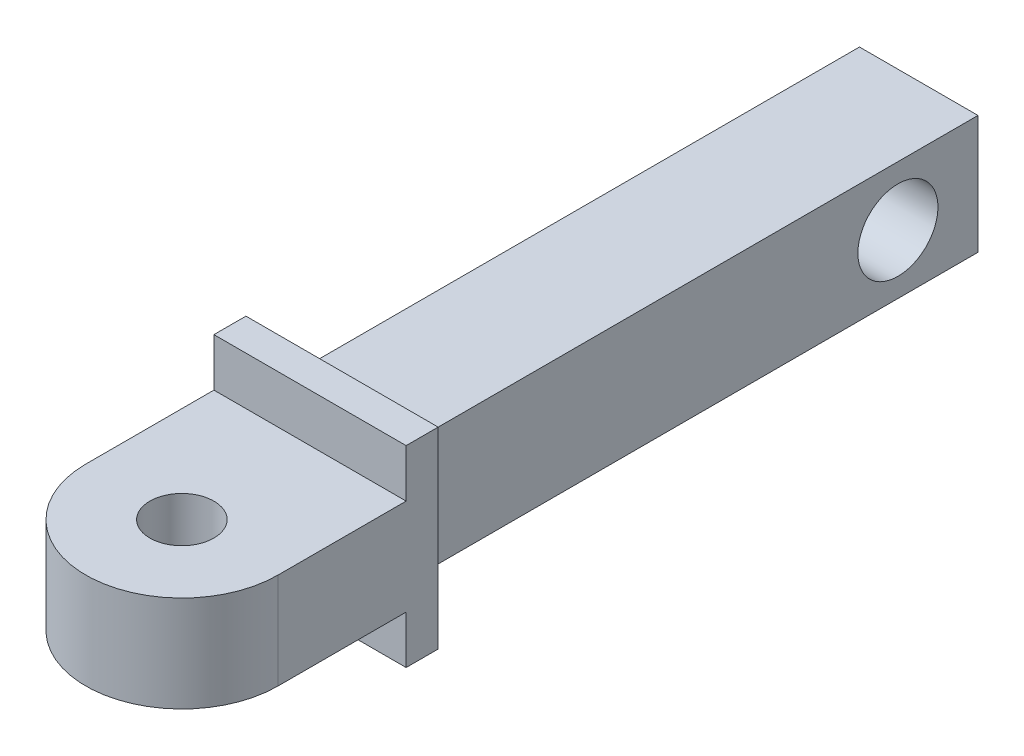
ISO-10303-21;
HEADER;
FILE_DESCRIPTION(('STEP AP214'),'2;1');
FILE_NAME('part.step','',(''),(''),'','','');
FILE_SCHEMA(('AUTOMOTIVE_DESIGN { 1 0 10303 214 1 1 1 1 }'));
ENDSEC;
DATA;
#1=APPLICATION_CONTEXT('core data for automotive mechanical design processes');
#2=APPLICATION_PROTOCOL_DEFINITION('international standard','automotive_design',2000,#1);
#3=PRODUCT_CONTEXT('',#1,'mechanical');
#4=PRODUCT('Part','Part','',(#3));
#5=PRODUCT_RELATED_PRODUCT_CATEGORY('part','',(#4));
#6=PRODUCT_DEFINITION_FORMATION('','',#4);
#7=PRODUCT_DEFINITION_CONTEXT('part definition',#1,'design');
#8=PRODUCT_DEFINITION('design','',#6,#7);
#9=PRODUCT_DEFINITION_SHAPE('','',#8);
#10=(LENGTH_UNIT() NAMED_UNIT(*) SI_UNIT(.MILLI.,.METRE.));
#11=(NAMED_UNIT(*) PLANE_ANGLE_UNIT() SI_UNIT($,.RADIAN.));
#12=(NAMED_UNIT(*) SI_UNIT($,.STERADIAN.) SOLID_ANGLE_UNIT());
#13=UNCERTAINTY_MEASURE_WITH_UNIT(LENGTH_MEASURE(1.E-05),#10,'distance_accuracy_value','');
#14=(GEOMETRIC_REPRESENTATION_CONTEXT(3) GLOBAL_UNCERTAINTY_ASSIGNED_CONTEXT((#13)) GLOBAL_UNIT_ASSIGNED_CONTEXT((#10,
#11,#12)) REPRESENTATION_CONTEXT('',''));
#15=CARTESIAN_POINT('',(0.,0.,0.));
#16=DIRECTION('',(0.,0.,1.));
#17=DIRECTION('',(1.,0.,0.));
#18=AXIS2_PLACEMENT_3D('',#15,#16,#17);
#19=CARTESIAN_POINT('',(0.,0.,0.));
#20=DIRECTION('',(0.,0.,-1.));
#21=DIRECTION('',(-1.,0.,0.));
#22=AXIS2_PLACEMENT_3D('',#19,#20,#21);
#23=PLANE('',#22);
#24=DIRECTION('',(0.,1.,0.));
#25=VECTOR('',#24,1.);
#26=CARTESIAN_POINT('',(3.,3.,0.));
#27=LINE('',#26,#25);
#28=CARTESIAN_POINT('',(3.,-3.,0.));
#29=VERTEX_POINT('',#28);
#30=CARTESIAN_POINT('',(3.,3.,0.));
#31=VERTEX_POINT('',#30);
#32=EDGE_CURVE('E180',#29,#31,#27,.T.);
#33=ORIENTED_EDGE('',*,*,#32,.F.);
#34=DIRECTION('',(1.,0.,0.));
#35=VECTOR('',#34,1.);
#36=CARTESIAN_POINT('',(3.,-3.,0.));
#37=LINE('',#36,#35);
#38=CARTESIAN_POINT('',(-3.,-3.,0.));
#39=VERTEX_POINT('',#38);
#40=EDGE_CURVE('E201',#39,#29,#37,.T.);
#41=ORIENTED_EDGE('',*,*,#40,.F.);
#42=DIRECTION('',(0.,-1.,0.));
#43=VECTOR('',#42,1.);
#44=CARTESIAN_POINT('',(-3.,3.,0.));
#45=LINE('',#44,#43);
#46=CARTESIAN_POINT('',(-3.,3.,0.));
#47=VERTEX_POINT('',#46);
#48=EDGE_CURVE('E199',#47,#39,#45,.T.);
#49=ORIENTED_EDGE('',*,*,#48,.F.);
#50=DIRECTION('',(-1.,0.,0.));
#51=VECTOR('',#50,1.);
#52=CARTESIAN_POINT('',(3.,3.,0.));
#53=LINE('',#52,#51);
#54=EDGE_CURVE('E197',#31,#47,#53,.T.);
#55=ORIENTED_EDGE('',*,*,#54,.F.);
#56=EDGE_LOOP('',(#33,#41,#49,#55));
#57=FACE_BOUND('',#56,.T.);
#58=DIRECTION('',(1.,0.,0.));
#59=VECTOR('',#58,1.);
#60=CARTESIAN_POINT('',(-1.85,1.85,0.));
#61=LINE('',#60,#59);
#62=CARTESIAN_POINT('',(-1.85,1.85,0.));
#63=VERTEX_POINT('',#62);
#64=CARTESIAN_POINT('',(1.85,1.85,0.));
#65=VERTEX_POINT('',#64);
#66=EDGE_CURVE('E311',#63,#65,#61,.T.);
#67=ORIENTED_EDGE('',*,*,#66,.F.);
#68=DIRECTION('',(0.,1.,0.));
#69=VECTOR('',#68,1.);
#70=CARTESIAN_POINT('',(-1.85,1.85,0.));
#71=LINE('',#70,#69);
#72=CARTESIAN_POINT('',(-1.85,-1.85,0.));
#73=VERTEX_POINT('',#72);
#74=EDGE_CURVE('E147',#73,#63,#71,.T.);
#75=ORIENTED_EDGE('',*,*,#74,.F.);
#76=DIRECTION('',(-1.,0.,0.));
#77=VECTOR('',#76,1.);
#78=CARTESIAN_POINT('',(-1.85,-1.85,0.));
#79=LINE('',#78,#77);
#80=CARTESIAN_POINT('',(1.85,-1.85,0.));
#81=VERTEX_POINT('',#80);
#82=EDGE_CURVE('E143',#81,#73,#79,.T.);
#83=ORIENTED_EDGE('',*,*,#82,.F.);
#84=DIRECTION('',(0.,-1.,0.));
#85=VECTOR('',#84,1.);
#86=CARTESIAN_POINT('',(1.85,1.85,0.));
#87=LINE('',#86,#85);
#88=EDGE_CURVE('E313',#65,#81,#87,.T.);
#89=ORIENTED_EDGE('',*,*,#88,.F.);
#90=EDGE_LOOP('',(#67,#75,#83,#89));
#91=FACE_BOUND('',#90,.T.);
#92=ADVANCED_FACE('F33',(#57,#91),#23,.T.);
#93=CARTESIAN_POINT('',(0.,0.,1.));
#94=DIRECTION('',(0.,0.,-1.));
#95=DIRECTION('',(-1.,0.,0.));
#96=AXIS2_PLACEMENT_3D('',#93,#94,#95);
#97=PLANE('',#96);
#98=DIRECTION('',(-1.,0.,0.));
#99=VECTOR('',#98,1.);
#100=CARTESIAN_POINT('',(-3.,1.5,1.));
#101=LINE('',#100,#99);
#102=CARTESIAN_POINT('',(3.,1.5,0.999999999999999));
#103=VERTEX_POINT('',#102);
#104=CARTESIAN_POINT('',(-3.,1.5,1.));
#105=VERTEX_POINT('',#104);
#106=EDGE_CURVE('E164',#103,#105,#101,.T.);
#107=ORIENTED_EDGE('',*,*,#106,.F.);
#108=DIRECTION('',(0.,1.,0.));
#109=VECTOR('',#108,1.);
#110=CARTESIAN_POINT('',(3.,3.,1.));
#111=LINE('',#110,#109);
#112=CARTESIAN_POINT('',(3.,3.,1.));
#113=VERTEX_POINT('',#112);
#114=EDGE_CURVE('E186',#103,#113,#111,.T.);
#115=ORIENTED_EDGE('',*,*,#114,.T.);
#116=DIRECTION('',(-1.,0.,0.));
#117=VECTOR('',#116,1.);
#118=CARTESIAN_POINT('',(3.,3.,1.));
#119=LINE('',#118,#117);
#120=CARTESIAN_POINT('',(-3.,3.,1.));
#121=VERTEX_POINT('',#120);
#122=EDGE_CURVE('E185',#113,#121,#119,.T.);
#123=ORIENTED_EDGE('',*,*,#122,.T.);
#124=DIRECTION('',(0.,-1.,0.));
#125=VECTOR('',#124,1.);
#126=CARTESIAN_POINT('',(-3.,3.,1.));
#127=LINE('',#126,#125);
#128=EDGE_CURVE('E189',#121,#105,#127,.T.);
#129=ORIENTED_EDGE('',*,*,#128,.T.);
#130=EDGE_LOOP('',(#107,#115,#123,#129));
#131=FACE_BOUND('',#130,.T.);
#132=ADVANCED_FACE('F242',(#131),#97,.F.);
#133=CARTESIAN_POINT('',(3.,3.,1.));
#134=DIRECTION('',(-1.,0.,0.));
#135=DIRECTION('',(0.,0.,1.));
#136=AXIS2_PLACEMENT_3D('',#133,#134,#135);
#137=PLANE('',#136);
#138=ORIENTED_EDGE('',*,*,#32,.T.);
#139=DIRECTION('',(0.,0.,-1.));
#140=VECTOR('',#139,1.);
#141=CARTESIAN_POINT('',(3.,3.,1.));
#142=LINE('',#141,#140);
#143=EDGE_CURVE('E11',#113,#31,#142,.T.);
#144=ORIENTED_EDGE('',*,*,#143,.F.);
#145=ORIENTED_EDGE('',*,*,#114,.F.);
#146=DIRECTION('',(0.,0.,-1.));
#147=VECTOR('',#146,1.);
#148=CARTESIAN_POINT('',(3.,1.5,0.999999999999999));
#149=LINE('',#148,#147);
#150=CARTESIAN_POINT('',(3.,1.5,5.));
#151=VERTEX_POINT('',#150);
#152=EDGE_CURVE('E162',#151,#103,#149,.T.);
#153=ORIENTED_EDGE('',*,*,#152,.F.);
#154=DIRECTION('',(0.,1.,0.));
#155=VECTOR('',#154,1.);
#156=CARTESIAN_POINT('',(3.,-1.5,5.));
#157=LINE('',#156,#155);
#158=CARTESIAN_POINT('',(3.,-1.5,5.));
#159=VERTEX_POINT('',#158);
#160=EDGE_CURVE('E178',#159,#151,#157,.T.);
#161=ORIENTED_EDGE('',*,*,#160,.F.);
#162=DIRECTION('',(0.,0.,-1.));
#163=VECTOR('',#162,1.);
#164=CARTESIAN_POINT('',(3.,-1.5,0.999999999999999));
#165=LINE('',#164,#163);
#166=CARTESIAN_POINT('',(3.,-1.5,0.999999999999999));
#167=VERTEX_POINT('',#166);
#168=EDGE_CURVE('E173',#159,#167,#165,.T.);
#169=ORIENTED_EDGE('',*,*,#168,.T.);
#170=CARTESIAN_POINT('',(3.,-3.,1.));
#171=VERTEX_POINT('',#170);
#172=EDGE_CURVE('E182',#171,#167,#111,.T.);
#173=ORIENTED_EDGE('',*,*,#172,.F.);
#174=DIRECTION('',(0.,0.,-1.));
#175=VECTOR('',#174,1.);
#176=CARTESIAN_POINT('',(3.,-3.,1.));
#177=LINE('',#176,#175);
#178=EDGE_CURVE('E194',#171,#29,#177,.T.);
#179=ORIENTED_EDGE('',*,*,#178,.T.);
#180=EDGE_LOOP('',(#138,#144,#145,#153,#161,#169,#173,#179));
#181=FACE_BOUND('',#180,.T.);
#182=ADVANCED_FACE('F35',(#181),#137,.F.);
#183=CARTESIAN_POINT('',(3.,3.,1.));
#184=DIRECTION('',(0.,-1.,0.));
#185=DIRECTION('',(1.,0.,0.));
#186=AXIS2_PLACEMENT_3D('',#183,#184,#185);
#187=PLANE('',#186);
#188=ORIENTED_EDGE('',*,*,#54,.T.);
#189=DIRECTION('',(0.,0.,-1.));
#190=VECTOR('',#189,1.);
#191=CARTESIAN_POINT('',(-3.,3.,1.));
#192=LINE('',#191,#190);
#193=EDGE_CURVE('E41',#121,#47,#192,.T.);
#194=ORIENTED_EDGE('',*,*,#193,.F.);
#195=ORIENTED_EDGE('',*,*,#122,.F.);
#196=ORIENTED_EDGE('',*,*,#143,.T.);
#197=EDGE_LOOP('',(#188,#194,#195,#196));
#198=FACE_BOUND('',#197,.T.);
#199=ADVANCED_FACE('F243',(#198),#187,.F.);
#200=CARTESIAN_POINT('',(-3.,3.,1.));
#201=DIRECTION('',(1.,0.,0.));
#202=DIRECTION('',(0.,0.,-1.));
#203=AXIS2_PLACEMENT_3D('',#200,#201,#202);
#204=PLANE('',#203);
#205=ORIENTED_EDGE('',*,*,#48,.T.);
#206=DIRECTION('',(0.,0.,-1.));
#207=VECTOR('',#206,1.);
#208=CARTESIAN_POINT('',(-3.,-3.,1.));
#209=LINE('',#208,#207);
#210=CARTESIAN_POINT('',(-3.,-3.,1.));
#211=VERTEX_POINT('',#210);
#212=EDGE_CURVE('E205',#211,#39,#209,.T.);
#213=ORIENTED_EDGE('',*,*,#212,.F.);
#214=CARTESIAN_POINT('',(-3.,-1.5,1.));
#215=VERTEX_POINT('',#214);
#216=EDGE_CURVE('E188',#215,#211,#127,.T.);
#217=ORIENTED_EDGE('',*,*,#216,.F.);
#218=DIRECTION('',(0.,0.,1.));
#219=VECTOR('',#218,1.);
#220=CARTESIAN_POINT('',(-3.,-1.5,1.));
#221=LINE('',#220,#219);
#222=CARTESIAN_POINT('',(-3.,-1.5,5.));
#223=VERTEX_POINT('',#222);
#224=EDGE_CURVE('E56',#215,#223,#221,.T.);
#225=ORIENTED_EDGE('',*,*,#224,.T.);
#226=DIRECTION('',(0.,1.,0.));
#227=VECTOR('',#226,1.);
#228=CARTESIAN_POINT('',(-3.,-1.5,5.));
#229=LINE('',#228,#227);
#230=CARTESIAN_POINT('',(-3.,1.5,5.));
#231=VERTEX_POINT('',#230);
#232=EDGE_CURVE('E177',#223,#231,#229,.T.);
#233=ORIENTED_EDGE('',*,*,#232,.T.);
#234=DIRECTION('',(0.,0.,1.));
#235=VECTOR('',#234,1.);
#236=CARTESIAN_POINT('',(-3.,1.5,1.));
#237=LINE('',#236,#235);
#238=EDGE_CURVE('E152',#105,#231,#237,.T.);
#239=ORIENTED_EDGE('',*,*,#238,.F.);
#240=ORIENTED_EDGE('',*,*,#128,.F.);
#241=ORIENTED_EDGE('',*,*,#193,.T.);
#242=EDGE_LOOP('',(#205,#213,#217,#225,#233,#239,#240,#241));
#243=FACE_BOUND('',#242,.T.);
#244=ADVANCED_FACE('F212',(#243),#204,.F.);
#245=CARTESIAN_POINT('',(3.,-3.,1.));
#246=DIRECTION('',(0.,1.,0.));
#247=DIRECTION('',(0.,0.,1.));
#248=AXIS2_PLACEMENT_3D('',#245,#246,#247);
#249=PLANE('',#248);
#250=ORIENTED_EDGE('',*,*,#40,.T.);
#251=ORIENTED_EDGE('',*,*,#178,.F.);
#252=DIRECTION('',(1.,0.,0.));
#253=VECTOR('',#252,1.);
#254=CARTESIAN_POINT('',(3.,-3.,1.));
#255=LINE('',#254,#253);
#256=EDGE_CURVE('E192',#211,#171,#255,.T.);
#257=ORIENTED_EDGE('',*,*,#256,.F.);
#258=ORIENTED_EDGE('',*,*,#212,.T.);
#259=EDGE_LOOP('',(#250,#251,#257,#258));
#260=FACE_BOUND('',#259,.T.);
#261=ADVANCED_FACE('F223',(#260),#249,.F.);
#262=ORIENTED_EDGE('',*,*,#172,.T.);
#263=DIRECTION('',(-1.,0.,0.));
#264=VECTOR('',#263,1.);
#265=CARTESIAN_POINT('',(-3.,-1.5,1.));
#266=LINE('',#265,#264);
#267=EDGE_CURVE('E175',#167,#215,#266,.T.);
#268=ORIENTED_EDGE('',*,*,#267,.T.);
#269=ORIENTED_EDGE('',*,*,#216,.T.);
#270=ORIENTED_EDGE('',*,*,#256,.T.);
#271=EDGE_LOOP('',(#262,#268,#269,#270));
#272=FACE_BOUND('',#271,.T.);
#273=ADVANCED_FACE('F230',(#272),#97,.F.);
#274=CARTESIAN_POINT('',(0.,-1.5,5.));
#275=DIRECTION('',(0.,1.,0.));
#276=DIRECTION('',(0.,0.,1.));
#277=AXIS2_PLACEMENT_3D('',#274,#275,#276);
#278=CYLINDRICAL_SURFACE('',#277,3.);
#279=ORIENTED_EDGE('',*,*,#160,.T.);
#280=CARTESIAN_POINT('',(0.,1.5,5.));
#281=DIRECTION('',(0.,1.,0.));
#282=DIRECTION('',(0.,0.,1.));
#283=AXIS2_PLACEMENT_3D('',#280,#281,#282);
#284=CIRCLE('',#283,3.);
#285=EDGE_CURVE('E159',#231,#151,#284,.T.);
#286=ORIENTED_EDGE('',*,*,#285,.F.);
#287=ORIENTED_EDGE('',*,*,#232,.F.);
#288=CARTESIAN_POINT('',(0.,-1.5,5.));
#289=DIRECTION('',(0.,1.,0.));
#290=DIRECTION('',(0.,0.,1.));
#291=AXIS2_PLACEMENT_3D('',#288,#289,#290);
#292=CIRCLE('',#291,3.);
#293=EDGE_CURVE('E170',#223,#159,#292,.T.);
#294=ORIENTED_EDGE('',*,*,#293,.T.);
#295=EDGE_LOOP('',(#279,#286,#287,#294));
#296=FACE_BOUND('',#295,.T.);
#297=ADVANCED_FACE('F234',(#296),#278,.T.);
#298=CARTESIAN_POINT('',(0.,-1.5,5.));
#299=DIRECTION('',(0.,1.,0.));
#300=DIRECTION('',(0.,0.,1.));
#301=AXIS2_PLACEMENT_3D('',#298,#299,#300);
#302=PLANE('',#301);
#303=CARTESIAN_POINT('',(0.,-1.5,5.));
#304=DIRECTION('',(0.,1.,0.));
#305=DIRECTION('',(0.,0.,1.));
#306=AXIS2_PLACEMENT_3D('',#303,#304,#305);
#307=CIRCLE('',#306,1.);
#308=CARTESIAN_POINT('',(0.,-1.5,6.));
#309=VERTEX_POINT('',#308);
#310=EDGE_CURVE('E166',#309,#309,#307,.T.);
#311=ORIENTED_EDGE('',*,*,#310,.T.);
#312=EDGE_LOOP('',(#311));
#313=FACE_BOUND('',#312,.T.);
#314=ORIENTED_EDGE('',*,*,#224,.F.);
#315=ORIENTED_EDGE('',*,*,#267,.F.);
#316=ORIENTED_EDGE('',*,*,#168,.F.);
#317=ORIENTED_EDGE('',*,*,#293,.F.);
#318=EDGE_LOOP('',(#314,#315,#316,#317));
#319=FACE_BOUND('',#318,.T.);
#320=ADVANCED_FACE('F265',(#313,#319),#302,.F.);
#321=CARTESIAN_POINT('',(0.,-1.5,5.));
#322=DIRECTION('',(0.,1.,0.));
#323=DIRECTION('',(0.,0.,1.));
#324=AXIS2_PLACEMENT_3D('',#321,#322,#323);
#325=CYLINDRICAL_SURFACE('',#324,1.);
#326=ORIENTED_EDGE('',*,*,#310,.F.);
#327=EDGE_LOOP('',(#326));
#328=FACE_BOUND('',#327,.T.);
#329=CARTESIAN_POINT('',(0.,1.5,5.));
#330=DIRECTION('',(0.,1.,0.));
#331=DIRECTION('',(0.,0.,1.));
#332=AXIS2_PLACEMENT_3D('',#329,#330,#331);
#333=CIRCLE('',#332,1.);
#334=CARTESIAN_POINT('',(0.,1.5,6.));
#335=VERTEX_POINT('',#334);
#336=EDGE_CURVE('E149',#335,#335,#333,.T.);
#337=ORIENTED_EDGE('',*,*,#336,.T.);
#338=EDGE_LOOP('',(#337));
#339=FACE_BOUND('',#338,.T.);
#340=ADVANCED_FACE('F269',(#328,#339),#325,.F.);
#341=CARTESIAN_POINT('',(0.,1.5,5.));
#342=DIRECTION('',(0.,1.,0.));
#343=DIRECTION('',(0.,0.,1.));
#344=AXIS2_PLACEMENT_3D('',#341,#342,#343);
#345=PLANE('',#344);
#346=ORIENTED_EDGE('',*,*,#238,.T.);
#347=ORIENTED_EDGE('',*,*,#285,.T.);
#348=ORIENTED_EDGE('',*,*,#152,.T.);
#349=ORIENTED_EDGE('',*,*,#106,.T.);
#350=EDGE_LOOP('',(#346,#347,#348,#349));
#351=FACE_BOUND('',#350,.T.);
#352=ORIENTED_EDGE('',*,*,#336,.F.);
#353=EDGE_LOOP('',(#352));
#354=FACE_BOUND('',#353,.T.);
#355=ADVANCED_FACE('F237',(#351,#354),#345,.T.);
#356=CARTESIAN_POINT('',(-1.85,1.85,-18.));
#357=DIRECTION('',(1.,0.,0.));
#358=DIRECTION('',(0.,1.,0.));
#359=AXIS2_PLACEMENT_3D('',#356,#357,#358);
#360=PLANE('',#359);
#361=CARTESIAN_POINT('',(-1.85,0.,-15.5));
#362=DIRECTION('',(-1.,0.,0.));
#363=DIRECTION('',(0.,0.,1.));
#364=AXIS2_PLACEMENT_3D('',#361,#362,#363);
#365=CIRCLE('',#364,1.25);
#366=CARTESIAN_POINT('',(-1.85,0.,-14.25));
#367=VERTEX_POINT('',#366);
#368=EDGE_CURVE('E303',#367,#367,#365,.T.);
#369=ORIENTED_EDGE('',*,*,#368,.F.);
#370=EDGE_LOOP('',(#369));
#371=FACE_BOUND('',#370,.T.);
#372=ORIENTED_EDGE('',*,*,#74,.T.);
#373=DIRECTION('',(0.,0.,1.));
#374=VECTOR('',#373,1.);
#375=CARTESIAN_POINT('',(-1.85,1.85,-18.));
#376=LINE('',#375,#374);
#377=CARTESIAN_POINT('',(-1.85,1.85,-18.));
#378=VERTEX_POINT('',#377);
#379=EDGE_CURVE('E128',#378,#63,#376,.T.);
#380=ORIENTED_EDGE('',*,*,#379,.F.);
#381=DIRECTION('',(0.,1.,0.));
#382=VECTOR('',#381,1.);
#383=CARTESIAN_POINT('',(-1.85,1.85,-18.));
#384=LINE('',#383,#382);
#385=CARTESIAN_POINT('',(-1.85,-1.85,-18.));
#386=VERTEX_POINT('',#385);
#387=EDGE_CURVE('E135',#386,#378,#384,.T.);
#388=ORIENTED_EDGE('',*,*,#387,.F.);
#389=DIRECTION('',(0.,0.,1.));
#390=VECTOR('',#389,1.);
#391=CARTESIAN_POINT('',(-1.85,-1.85,-18.));
#392=LINE('',#391,#390);
#393=EDGE_CURVE('E309',#386,#73,#392,.T.);
#394=ORIENTED_EDGE('',*,*,#393,.T.);
#395=EDGE_LOOP('',(#372,#380,#388,#394));
#396=FACE_BOUND('',#395,.T.);
#397=ADVANCED_FACE('F145',(#371,#396),#360,.F.);
#398=CARTESIAN_POINT('',(-1.85,1.85,-18.));
#399=DIRECTION('',(0.,-1.,0.));
#400=DIRECTION('',(0.,0.,-1.));
#401=AXIS2_PLACEMENT_3D('',#398,#399,#400);
#402=PLANE('',#401);
#403=ORIENTED_EDGE('',*,*,#66,.T.);
#404=DIRECTION('',(0.,0.,1.));
#405=VECTOR('',#404,1.);
#406=CARTESIAN_POINT('',(1.85,1.85,-18.));
#407=LINE('',#406,#405);
#408=CARTESIAN_POINT('',(1.85,1.85,-18.));
#409=VERTEX_POINT('',#408);
#410=EDGE_CURVE('E131',#409,#65,#407,.T.);
#411=ORIENTED_EDGE('',*,*,#410,.F.);
#412=DIRECTION('',(1.,0.,0.));
#413=VECTOR('',#412,1.);
#414=CARTESIAN_POINT('',(-1.85,1.85,-18.));
#415=LINE('',#414,#413);
#416=EDGE_CURVE('E124',#378,#409,#415,.T.);
#417=ORIENTED_EDGE('',*,*,#416,.F.);
#418=ORIENTED_EDGE('',*,*,#379,.T.);
#419=EDGE_LOOP('',(#403,#411,#417,#418));
#420=FACE_BOUND('',#419,.T.);
#421=ADVANCED_FACE('F126',(#420),#402,.F.);
#422=CARTESIAN_POINT('',(1.85,1.85,-18.));
#423=DIRECTION('',(-1.,0.,0.));
#424=DIRECTION('',(0.,0.,1.));
#425=AXIS2_PLACEMENT_3D('',#422,#423,#424);
#426=PLANE('',#425);
#427=CARTESIAN_POINT('',(1.85,0.,-15.5));
#428=DIRECTION('',(-1.,0.,0.));
#429=DIRECTION('',(0.,0.,1.));
#430=AXIS2_PLACEMENT_3D('',#427,#428,#429);
#431=CIRCLE('',#430,1.25);
#432=CARTESIAN_POINT('',(1.85,0.,-14.25));
#433=VERTEX_POINT('',#432);
#434=EDGE_CURVE('E300',#433,#433,#431,.F.);
#435=ORIENTED_EDGE('',*,*,#434,.F.);
#436=EDGE_LOOP('',(#435));
#437=FACE_BOUND('',#436,.T.);
#438=ORIENTED_EDGE('',*,*,#88,.T.);
#439=DIRECTION('',(0.,0.,1.));
#440=VECTOR('',#439,1.);
#441=CARTESIAN_POINT('',(1.85,-1.85,-18.));
#442=LINE('',#441,#440);
#443=CARTESIAN_POINT('',(1.85,-1.85,-18.));
#444=VERTEX_POINT('',#443);
#445=EDGE_CURVE('E48',#444,#81,#442,.T.);
#446=ORIENTED_EDGE('',*,*,#445,.F.);
#447=DIRECTION('',(0.,-1.,0.));
#448=VECTOR('',#447,1.);
#449=CARTESIAN_POINT('',(1.85,1.85,-18.));
#450=LINE('',#449,#448);
#451=EDGE_CURVE('E134',#409,#444,#450,.T.);
#452=ORIENTED_EDGE('',*,*,#451,.F.);
#453=ORIENTED_EDGE('',*,*,#410,.T.);
#454=EDGE_LOOP('',(#438,#446,#452,#453));
#455=FACE_BOUND('',#454,.T.);
#456=ADVANCED_FACE('F283',(#437,#455),#426,.F.);
#457=CARTESIAN_POINT('',(-1.85,-1.85,-18.));
#458=DIRECTION('',(0.,1.,0.));
#459=DIRECTION('',(0.,0.,1.));
#460=AXIS2_PLACEMENT_3D('',#457,#458,#459);
#461=PLANE('',#460);
#462=ORIENTED_EDGE('',*,*,#82,.T.);
#463=ORIENTED_EDGE('',*,*,#393,.F.);
#464=DIRECTION('',(-1.,0.,0.));
#465=VECTOR('',#464,1.);
#466=CARTESIAN_POINT('',(-1.85,-1.85,-18.));
#467=LINE('',#466,#465);
#468=EDGE_CURVE('E139',#444,#386,#467,.T.);
#469=ORIENTED_EDGE('',*,*,#468,.F.);
#470=ORIENTED_EDGE('',*,*,#445,.T.);
#471=EDGE_LOOP('',(#462,#463,#469,#470));
#472=FACE_BOUND('',#471,.T.);
#473=ADVANCED_FACE('F286',(#472),#461,.F.);
#474=CARTESIAN_POINT('',(0.,0.,-18.));
#475=DIRECTION('',(0.,0.,1.));
#476=DIRECTION('',(1.,0.,0.));
#477=AXIS2_PLACEMENT_3D('',#474,#475,#476);
#478=PLANE('',#477);
#479=ORIENTED_EDGE('',*,*,#387,.T.);
#480=ORIENTED_EDGE('',*,*,#416,.T.);
#481=ORIENTED_EDGE('',*,*,#451,.T.);
#482=ORIENTED_EDGE('',*,*,#468,.T.);
#483=EDGE_LOOP('',(#479,#480,#481,#482));
#484=FACE_BOUND('',#483,.T.);
#485=ADVANCED_FACE('F138',(#484),#478,.F.);
#486=CARTESIAN_POINT('',(5.38553390593274,0.,-15.5));
#487=DIRECTION('',(-1.,0.,0.));
#488=DIRECTION('',(0.,0.,1.));
#489=AXIS2_PLACEMENT_3D('',#486,#487,#488);
#490=CYLINDRICAL_SURFACE('',#489,1.25);
#491=ORIENTED_EDGE('',*,*,#434,.T.);
#492=EDGE_LOOP('',(#491));
#493=FACE_BOUND('',#492,.T.);
#494=ORIENTED_EDGE('',*,*,#368,.T.);
#495=EDGE_LOOP('',(#494));
#496=FACE_BOUND('',#495,.T.);
#497=ADVANCED_FACE('F292',(#493,#496),#490,.F.);
#498=CLOSED_SHELL('',(#92,#132,#182,#199,#244,#261,#273,#297,#320,#340,#355,#397,#421,#456,#473,
#485,#497));
#499=MANIFOLD_SOLID_BREP('B2',#498);
#500=ADVANCED_BREP_SHAPE_REPRESENTATION('',(#18,#499),#14);
#501=SHAPE_DEFINITION_REPRESENTATION(#9,#500);
ENDSEC;
END-ISO-10303-21;
